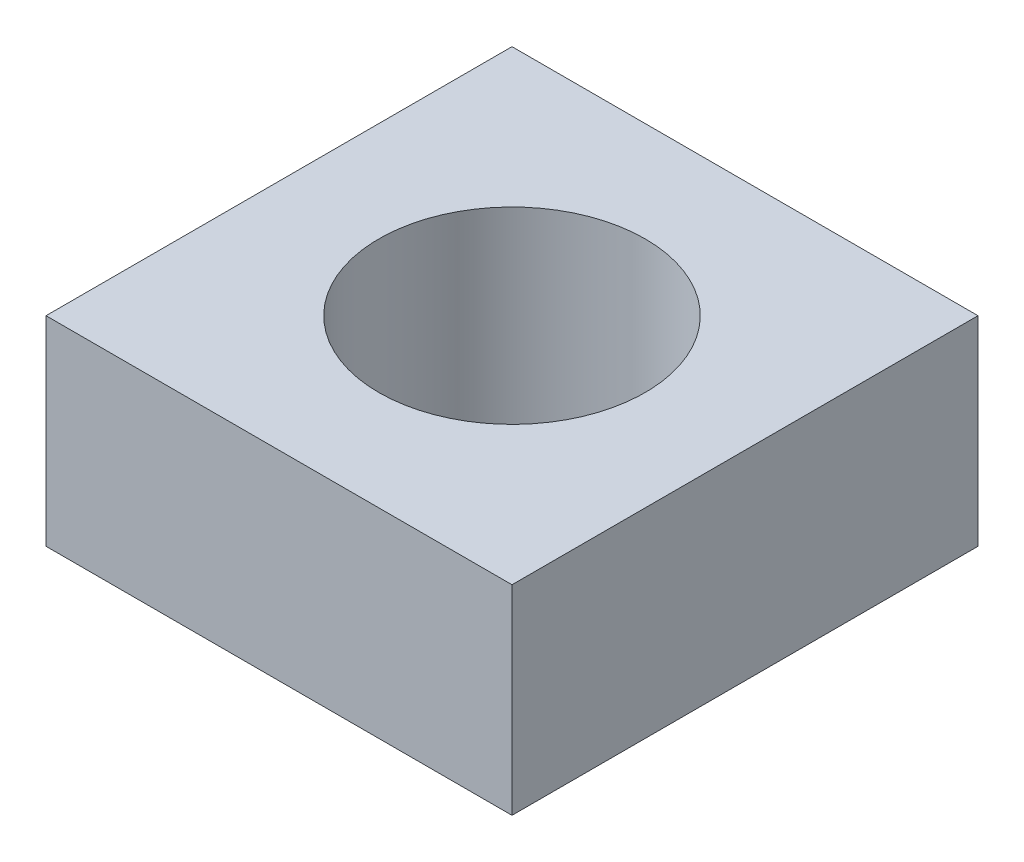
ISO-10303-21;
HEADER;
FILE_DESCRIPTION(('STEP AP214'),'2;1');
FILE_NAME('part.step','',(''),(''),'','','');
FILE_SCHEMA(('AUTOMOTIVE_DESIGN { 1 0 10303 214 1 1 1 1 }'));
ENDSEC;
DATA;
#1=APPLICATION_CONTEXT('core data for automotive mechanical design processes');
#2=APPLICATION_PROTOCOL_DEFINITION('international standard','automotive_design',2000,#1);
#3=PRODUCT_CONTEXT('',#1,'mechanical');
#4=PRODUCT('Part','Part','',(#3));
#5=PRODUCT_RELATED_PRODUCT_CATEGORY('part','',(#4));
#6=PRODUCT_DEFINITION_FORMATION('','',#4);
#7=PRODUCT_DEFINITION_CONTEXT('part definition',#1,'design');
#8=PRODUCT_DEFINITION('design','',#6,#7);
#9=PRODUCT_DEFINITION_SHAPE('','',#8);
#10=(LENGTH_UNIT() NAMED_UNIT(*) SI_UNIT(.MILLI.,.METRE.));
#11=(NAMED_UNIT(*) PLANE_ANGLE_UNIT() SI_UNIT($,.RADIAN.));
#12=(NAMED_UNIT(*) SI_UNIT($,.STERADIAN.) SOLID_ANGLE_UNIT());
#13=UNCERTAINTY_MEASURE_WITH_UNIT(LENGTH_MEASURE(1.E-05),#10,'distance_accuracy_value','');
#14=(GEOMETRIC_REPRESENTATION_CONTEXT(3) GLOBAL_UNCERTAINTY_ASSIGNED_CONTEXT((#13)) GLOBAL_UNIT_ASSIGNED_CONTEXT((#10,
#11,#12)) REPRESENTATION_CONTEXT('',''));
#15=CARTESIAN_POINT('',(0.,0.,0.));
#16=DIRECTION('',(0.,0.,1.));
#17=DIRECTION('',(1.,0.,0.));
#18=AXIS2_PLACEMENT_3D('',#15,#16,#17);
#19=CARTESIAN_POINT('',(0.,0.,22.225));
#20=DIRECTION('',(1.,0.,0.));
#21=DIRECTION('',(0.,0.,-1.));
#22=AXIS2_PLACEMENT_3D('',#19,#20,#21);
#23=PLANE('',#22);
#24=DIRECTION('',(0.,-1.,0.));
#25=VECTOR('',#24,1.);
#26=CARTESIAN_POINT('',(0.,0.,0.));
#27=LINE('',#26,#25);
#28=CARTESIAN_POINT('',(0.,9.525,0.));
#29=VERTEX_POINT('',#28);
#30=CARTESIAN_POINT('',(0.,0.,0.));
#31=VERTEX_POINT('',#30);
#32=EDGE_CURVE('E94',#29,#31,#27,.T.);
#33=ORIENTED_EDGE('',*,*,#32,.T.);
#34=DIRECTION('',(0.,0.,-1.));
#35=VECTOR('',#34,1.);
#36=CARTESIAN_POINT('',(0.,0.,22.225));
#37=LINE('',#36,#35);
#38=CARTESIAN_POINT('',(0.,0.,22.225));
#39=VERTEX_POINT('',#38);
#40=EDGE_CURVE('E11',#39,#31,#37,.T.);
#41=ORIENTED_EDGE('',*,*,#40,.F.);
#42=DIRECTION('',(0.,-1.,0.));
#43=VECTOR('',#42,1.);
#44=CARTESIAN_POINT('',(0.,0.,22.225));
#45=LINE('',#44,#43);
#46=CARTESIAN_POINT('',(0.,9.525,22.225));
#47=VERTEX_POINT('',#46);
#48=EDGE_CURVE('E82',#47,#39,#45,.T.);
#49=ORIENTED_EDGE('',*,*,#48,.F.);
#50=DIRECTION('',(0.,0.,-1.));
#51=VECTOR('',#50,1.);
#52=CARTESIAN_POINT('',(0.,9.525,22.225));
#53=LINE('',#52,#51);
#54=EDGE_CURVE('E90',#47,#29,#53,.T.);
#55=ORIENTED_EDGE('',*,*,#54,.T.);
#56=EDGE_LOOP('',(#33,#41,#49,#55));
#57=FACE_BOUND('',#56,.T.);
#58=ADVANCED_FACE('F31',(#57),#23,.F.);
#59=CARTESIAN_POINT('',(0.,0.,22.225));
#60=DIRECTION('',(0.,1.,0.));
#61=DIRECTION('',(0.,0.,1.));
#62=AXIS2_PLACEMENT_3D('',#59,#60,#61);
#63=PLANE('',#62);
#64=CARTESIAN_POINT('',(11.1125,0.,11.1125));
#65=DIRECTION('',(0.,1.,0.));
#66=DIRECTION('',(0.,0.,1.));
#67=AXIS2_PLACEMENT_3D('',#64,#65,#66);
#68=CIRCLE('',#67,6.35);
#69=CARTESIAN_POINT('',(11.1125,0.,17.4625));
#70=VERTEX_POINT('',#69);
#71=EDGE_CURVE('E97',#70,#70,#68,.T.);
#72=ORIENTED_EDGE('',*,*,#71,.T.);
#73=EDGE_LOOP('',(#72));
#74=FACE_BOUND('',#73,.T.);
#75=DIRECTION('',(1.,0.,0.));
#76=VECTOR('',#75,1.);
#77=CARTESIAN_POINT('',(0.,0.,0.));
#78=LINE('',#77,#76);
#79=CARTESIAN_POINT('',(22.225,0.,0.));
#80=VERTEX_POINT('',#79);
#81=EDGE_CURVE('E86',#31,#80,#78,.T.);
#82=ORIENTED_EDGE('',*,*,#81,.T.);
#83=DIRECTION('',(0.,0.,-1.));
#84=VECTOR('',#83,1.);
#85=CARTESIAN_POINT('',(22.225,0.,22.225));
#86=LINE('',#85,#84);
#87=CARTESIAN_POINT('',(22.225,0.,22.225));
#88=VERTEX_POINT('',#87);
#89=EDGE_CURVE('E39',#88,#80,#86,.T.);
#90=ORIENTED_EDGE('',*,*,#89,.F.);
#91=DIRECTION('',(1.,0.,0.));
#92=VECTOR('',#91,1.);
#93=CARTESIAN_POINT('',(0.,0.,22.225));
#94=LINE('',#93,#92);
#95=EDGE_CURVE('E77',#39,#88,#94,.T.);
#96=ORIENTED_EDGE('',*,*,#95,.F.);
#97=ORIENTED_EDGE('',*,*,#40,.T.);
#98=EDGE_LOOP('',(#82,#90,#96,#97));
#99=FACE_BOUND('',#98,.T.);
#100=ADVANCED_FACE('F85',(#74,#99),#63,.F.);
#101=CARTESIAN_POINT('',(22.225,0.,22.225));
#102=DIRECTION('',(-1.,0.,0.));
#103=DIRECTION('',(0.,0.,1.));
#104=AXIS2_PLACEMENT_3D('',#101,#102,#103);
#105=PLANE('',#104);
#106=DIRECTION('',(0.,1.,0.));
#107=VECTOR('',#106,1.);
#108=CARTESIAN_POINT('',(22.225,0.,0.));
#109=LINE('',#108,#107);
#110=CARTESIAN_POINT('',(22.225,9.525,0.));
#111=VERTEX_POINT('',#110);
#112=EDGE_CURVE('E64',#80,#111,#109,.T.);
#113=ORIENTED_EDGE('',*,*,#112,.T.);
#114=DIRECTION('',(0.,0.,-1.));
#115=VECTOR('',#114,1.);
#116=CARTESIAN_POINT('',(22.225,9.525,22.225));
#117=LINE('',#116,#115);
#118=CARTESIAN_POINT('',(22.225,9.525,22.225));
#119=VERTEX_POINT('',#118);
#120=EDGE_CURVE('E87',#119,#111,#117,.T.);
#121=ORIENTED_EDGE('',*,*,#120,.F.);
#122=DIRECTION('',(0.,1.,0.));
#123=VECTOR('',#122,1.);
#124=CARTESIAN_POINT('',(22.225,0.,22.225));
#125=LINE('',#124,#123);
#126=EDGE_CURVE('E80',#88,#119,#125,.T.);
#127=ORIENTED_EDGE('',*,*,#126,.F.);
#128=ORIENTED_EDGE('',*,*,#89,.T.);
#129=EDGE_LOOP('',(#113,#121,#127,#128));
#130=FACE_BOUND('',#129,.T.);
#131=ADVANCED_FACE('F88',(#130),#105,.F.);
#132=CARTESIAN_POINT('',(0.,9.525,22.225));
#133=DIRECTION('',(0.,-1.,0.));
#134=DIRECTION('',(0.,0.,-1.));
#135=AXIS2_PLACEMENT_3D('',#132,#133,#134);
#136=PLANE('',#135);
#137=CARTESIAN_POINT('',(11.1125,9.525,11.1125));
#138=DIRECTION('',(0.,1.,0.));
#139=DIRECTION('',(0.,0.,1.));
#140=AXIS2_PLACEMENT_3D('',#137,#138,#139);
#141=CIRCLE('',#140,6.35);
#142=CARTESIAN_POINT('',(11.1125,9.525,17.4625));
#143=VERTEX_POINT('',#142);
#144=EDGE_CURVE('E110',#143,#143,#141,.T.);
#145=ORIENTED_EDGE('',*,*,#144,.F.);
#146=EDGE_LOOP('',(#145));
#147=FACE_BOUND('',#146,.T.);
#148=DIRECTION('',(-1.,0.,0.));
#149=VECTOR('',#148,1.);
#150=CARTESIAN_POINT('',(0.,9.525,0.));
#151=LINE('',#150,#149);
#152=EDGE_CURVE('E70',#111,#29,#151,.T.);
#153=ORIENTED_EDGE('',*,*,#152,.T.);
#154=ORIENTED_EDGE('',*,*,#54,.F.);
#155=DIRECTION('',(-1.,0.,0.));
#156=VECTOR('',#155,1.);
#157=CARTESIAN_POINT('',(0.,9.525,22.225));
#158=LINE('',#157,#156);
#159=EDGE_CURVE('E47',#119,#47,#158,.T.);
#160=ORIENTED_EDGE('',*,*,#159,.F.);
#161=ORIENTED_EDGE('',*,*,#120,.T.);
#162=EDGE_LOOP('',(#153,#154,#160,#161));
#163=FACE_BOUND('',#162,.T.);
#164=ADVANCED_FACE('F102',(#147,#163),#136,.F.);
#165=CARTESIAN_POINT('',(0.,9.525,22.225));
#166=DIRECTION('',(0.,0.,-1.));
#167=DIRECTION('',(-1.,0.,0.));
#168=AXIS2_PLACEMENT_3D('',#165,#166,#167);
#169=PLANE('',#168);
#170=ORIENTED_EDGE('',*,*,#48,.T.);
#171=ORIENTED_EDGE('',*,*,#95,.T.);
#172=ORIENTED_EDGE('',*,*,#126,.T.);
#173=ORIENTED_EDGE('',*,*,#159,.T.);
#174=EDGE_LOOP('',(#170,#171,#172,#173));
#175=FACE_BOUND('',#174,.T.);
#176=ADVANCED_FACE('F78',(#175),#169,.F.);
#177=CARTESIAN_POINT('',(0.,9.525,0.));
#178=DIRECTION('',(0.,0.,-1.));
#179=DIRECTION('',(-1.,0.,0.));
#180=AXIS2_PLACEMENT_3D('',#177,#178,#179);
#181=PLANE('',#180);
#182=ORIENTED_EDGE('',*,*,#32,.F.);
#183=ORIENTED_EDGE('',*,*,#152,.F.);
#184=ORIENTED_EDGE('',*,*,#112,.F.);
#185=ORIENTED_EDGE('',*,*,#81,.F.);
#186=EDGE_LOOP('',(#182,#183,#184,#185));
#187=FACE_BOUND('',#186,.T.);
#188=ADVANCED_FACE('F105',(#187),#181,.T.);
#189=CARTESIAN_POINT('',(11.1125,-12.7,11.1125));
#190=DIRECTION('',(0.,1.,0.));
#191=DIRECTION('',(0.,0.,1.));
#192=AXIS2_PLACEMENT_3D('',#189,#190,#191);
#193=CYLINDRICAL_SURFACE('',#192,6.35);
#194=ORIENTED_EDGE('',*,*,#144,.T.);
#195=EDGE_LOOP('',(#194));
#196=FACE_BOUND('',#195,.T.);
#197=ORIENTED_EDGE('',*,*,#71,.F.);
#198=EDGE_LOOP('',(#197));
#199=FACE_BOUND('',#198,.T.);
#200=ADVANCED_FACE('F114',(#196,#199),#193,.F.);
#201=CLOSED_SHELL('',(#58,#100,#131,#164,#176,#188,#200));
#202=MANIFOLD_SOLID_BREP('B2',#201);
#203=ADVANCED_BREP_SHAPE_REPRESENTATION('',(#18,#202),#14);
#204=SHAPE_DEFINITION_REPRESENTATION(#9,#203);
ENDSEC;
END-ISO-10303-21;
